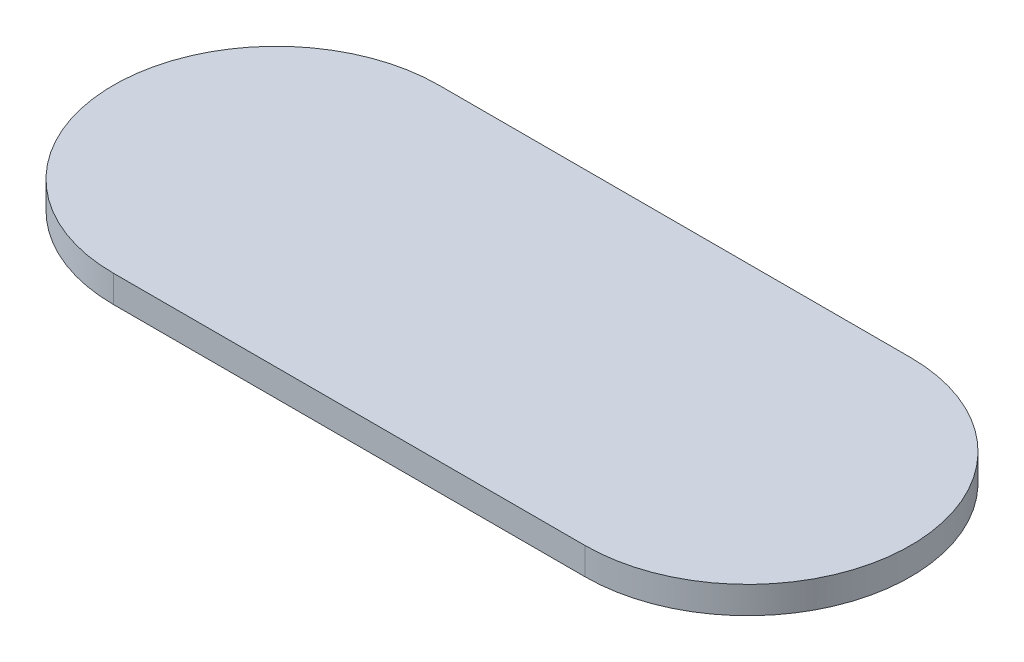
ISO-10303-21;
HEADER;
FILE_DESCRIPTION(('STEP AP214'),'2;1');
FILE_NAME('part.step','',(''),(''),'','','');
FILE_SCHEMA(('AUTOMOTIVE_DESIGN { 1 0 10303 214 1 1 1 1 }'));
ENDSEC;
DATA;
#1=APPLICATION_CONTEXT('core data for automotive mechanical design processes');
#2=APPLICATION_PROTOCOL_DEFINITION('international standard','automotive_design',2000,#1);
#3=PRODUCT_CONTEXT('',#1,'mechanical');
#4=PRODUCT('Part','Part','',(#3));
#5=PRODUCT_RELATED_PRODUCT_CATEGORY('part','',(#4));
#6=PRODUCT_DEFINITION_FORMATION('','',#4);
#7=PRODUCT_DEFINITION_CONTEXT('part definition',#1,'design');
#8=PRODUCT_DEFINITION('design','',#6,#7);
#9=PRODUCT_DEFINITION_SHAPE('','',#8);
#10=(LENGTH_UNIT() NAMED_UNIT(*) SI_UNIT(.MILLI.,.METRE.));
#11=(NAMED_UNIT(*) PLANE_ANGLE_UNIT() SI_UNIT($,.RADIAN.));
#12=(NAMED_UNIT(*) SI_UNIT($,.STERADIAN.) SOLID_ANGLE_UNIT());
#13=UNCERTAINTY_MEASURE_WITH_UNIT(LENGTH_MEASURE(1.E-05),#10,'distance_accuracy_value','');
#14=(GEOMETRIC_REPRESENTATION_CONTEXT(3) GLOBAL_UNCERTAINTY_ASSIGNED_CONTEXT((#13)) GLOBAL_UNIT_ASSIGNED_CONTEXT((#10,
#11,#12)) REPRESENTATION_CONTEXT('',''));
#15=CARTESIAN_POINT('',(0.,0.,0.));
#16=DIRECTION('',(0.,0.,1.));
#17=DIRECTION('',(1.,0.,0.));
#18=AXIS2_PLACEMENT_3D('',#15,#16,#17);
#19=CARTESIAN_POINT('',(-114.392523364486,10.,0.));
#20=DIRECTION('',(0.,-1.,0.));
#21=DIRECTION('',(0.,0.,-1.));
#22=AXIS2_PLACEMENT_3D('',#19,#20,#21);
#23=CYLINDRICAL_SURFACE('',#22,60.);
#24=CARTESIAN_POINT('',(-114.392523364486,0.,0.));
#25=DIRECTION('',(0.,1.,0.));
#26=DIRECTION('',(0.,0.,1.));
#27=AXIS2_PLACEMENT_3D('',#24,#25,#26);
#28=CIRCLE('',#27,60.);
#29=CARTESIAN_POINT('',(-114.392523364486,0.,-60.));
#30=VERTEX_POINT('',#29);
#31=CARTESIAN_POINT('',(-114.392523364486,0.,60.));
#32=VERTEX_POINT('',#31);
#33=EDGE_CURVE('E113',#30,#32,#28,.T.);
#34=ORIENTED_EDGE('',*,*,#33,.T.);
#35=DIRECTION('',(0.,-1.,0.));
#36=VECTOR('',#35,1.);
#37=CARTESIAN_POINT('',(-114.392523364486,10.,60.));
#38=LINE('',#37,#36);
#39=CARTESIAN_POINT('',(-114.392523364486,10.,60.));
#40=VERTEX_POINT('',#39);
#41=EDGE_CURVE('E11',#40,#32,#38,.T.);
#42=ORIENTED_EDGE('',*,*,#41,.F.);
#43=CARTESIAN_POINT('',(-114.392523364486,10.,0.));
#44=DIRECTION('',(0.,1.,0.));
#45=DIRECTION('',(0.,0.,1.));
#46=AXIS2_PLACEMENT_3D('',#43,#44,#45);
#47=CIRCLE('',#46,60.);
#48=CARTESIAN_POINT('',(-114.392523364486,10.,-60.));
#49=VERTEX_POINT('',#48);
#50=EDGE_CURVE('E97',#49,#40,#47,.T.);
#51=ORIENTED_EDGE('',*,*,#50,.F.);
#52=DIRECTION('',(0.,-1.,0.));
#53=VECTOR('',#52,1.);
#54=CARTESIAN_POINT('',(-114.392523364486,10.,-60.));
#55=LINE('',#54,#53);
#56=EDGE_CURVE('E109',#49,#30,#55,.T.);
#57=ORIENTED_EDGE('',*,*,#56,.T.);
#58=EDGE_LOOP('',(#34,#42,#51,#57));
#59=FACE_BOUND('',#58,.T.);
#60=ADVANCED_FACE('F45',(#59),#23,.T.);
#61=CARTESIAN_POINT('',(-114.392523364486,10.,60.));
#62=DIRECTION('',(0.,0.,-1.));
#63=DIRECTION('',(-1.,0.,0.));
#64=AXIS2_PLACEMENT_3D('',#61,#62,#63);
#65=PLANE('',#64);
#66=DIRECTION('',(1.,0.,0.));
#67=VECTOR('',#66,1.);
#68=CARTESIAN_POINT('',(-114.392523364486,0.,60.));
#69=LINE('',#68,#67);
#70=CARTESIAN_POINT('',(59.4392523364487,0.,60.));
#71=VERTEX_POINT('',#70);
#72=EDGE_CURVE('E102',#32,#71,#69,.T.);
#73=ORIENTED_EDGE('',*,*,#72,.T.);
#74=DIRECTION('',(0.,-1.,0.));
#75=VECTOR('',#74,1.);
#76=CARTESIAN_POINT('',(59.4392523364487,10.,60.));
#77=LINE('',#76,#75);
#78=CARTESIAN_POINT('',(59.4392523364487,10.,60.));
#79=VERTEX_POINT('',#78);
#80=EDGE_CURVE('E54',#79,#71,#77,.T.);
#81=ORIENTED_EDGE('',*,*,#80,.F.);
#82=DIRECTION('',(1.,0.,0.));
#83=VECTOR('',#82,1.);
#84=CARTESIAN_POINT('',(-114.392523364486,10.,60.));
#85=LINE('',#84,#83);
#86=EDGE_CURVE('E92',#40,#79,#85,.T.);
#87=ORIENTED_EDGE('',*,*,#86,.F.);
#88=ORIENTED_EDGE('',*,*,#41,.T.);
#89=EDGE_LOOP('',(#73,#81,#87,#88));
#90=FACE_BOUND('',#89,.T.);
#91=ADVANCED_FACE('F101',(#90),#65,.F.);
#92=CARTESIAN_POINT('',(59.4392523364487,10.,0.));
#93=DIRECTION('',(0.,-1.,0.));
#94=DIRECTION('',(0.,0.,-1.));
#95=AXIS2_PLACEMENT_3D('',#92,#93,#94);
#96=CYLINDRICAL_SURFACE('',#95,60.);
#97=CARTESIAN_POINT('',(59.4392523364487,0.,0.));
#98=DIRECTION('',(0.,1.,0.));
#99=DIRECTION('',(0.,0.,1.));
#100=AXIS2_PLACEMENT_3D('',#97,#98,#99);
#101=CIRCLE('',#100,60.);
#102=CARTESIAN_POINT('',(59.4392523364487,0.,-60.));
#103=VERTEX_POINT('',#102);
#104=EDGE_CURVE('E79',#71,#103,#101,.T.);
#105=ORIENTED_EDGE('',*,*,#104,.T.);
#106=DIRECTION('',(0.,-1.,0.));
#107=VECTOR('',#106,1.);
#108=CARTESIAN_POINT('',(59.4392523364487,10.,-60.));
#109=LINE('',#108,#107);
#110=CARTESIAN_POINT('',(59.4392523364487,10.,-60.));
#111=VERTEX_POINT('',#110);
#112=EDGE_CURVE('E104',#111,#103,#109,.T.);
#113=ORIENTED_EDGE('',*,*,#112,.F.);
#114=CARTESIAN_POINT('',(59.4392523364487,10.,0.));
#115=DIRECTION('',(0.,1.,0.));
#116=DIRECTION('',(0.,0.,1.));
#117=AXIS2_PLACEMENT_3D('',#114,#115,#116);
#118=CIRCLE('',#117,60.);
#119=EDGE_CURVE('E95',#79,#111,#118,.T.);
#120=ORIENTED_EDGE('',*,*,#119,.F.);
#121=ORIENTED_EDGE('',*,*,#80,.T.);
#122=EDGE_LOOP('',(#105,#113,#120,#121));
#123=FACE_BOUND('',#122,.T.);
#124=ADVANCED_FACE('F105',(#123),#96,.T.);
#125=CARTESIAN_POINT('',(-114.392523364486,10.,-60.));
#126=DIRECTION('',(0.,0.,1.));
#127=DIRECTION('',(1.,0.,0.));
#128=AXIS2_PLACEMENT_3D('',#125,#126,#127);
#129=PLANE('',#128);
#130=DIRECTION('',(-1.,0.,0.));
#131=VECTOR('',#130,1.);
#132=CARTESIAN_POINT('',(-114.392523364486,0.,-60.));
#133=LINE('',#132,#131);
#134=EDGE_CURVE('E85',#103,#30,#133,.T.);
#135=ORIENTED_EDGE('',*,*,#134,.T.);
#136=ORIENTED_EDGE('',*,*,#56,.F.);
#137=DIRECTION('',(-1.,0.,0.));
#138=VECTOR('',#137,1.);
#139=CARTESIAN_POINT('',(-114.392523364486,10.,-60.));
#140=LINE('',#139,#138);
#141=EDGE_CURVE('E62',#111,#49,#140,.T.);
#142=ORIENTED_EDGE('',*,*,#141,.F.);
#143=ORIENTED_EDGE('',*,*,#112,.T.);
#144=EDGE_LOOP('',(#135,#136,#142,#143));
#145=FACE_BOUND('',#144,.T.);
#146=ADVANCED_FACE('F126',(#145),#129,.F.);
#147=CARTESIAN_POINT('',(-114.392523364486,10.,0.));
#148=DIRECTION('',(0.,1.,0.));
#149=DIRECTION('',(0.,0.,1.));
#150=AXIS2_PLACEMENT_3D('',#147,#148,#149);
#151=PLANE('',#150);
#152=ORIENTED_EDGE('',*,*,#50,.T.);
#153=ORIENTED_EDGE('',*,*,#86,.T.);
#154=ORIENTED_EDGE('',*,*,#119,.T.);
#155=ORIENTED_EDGE('',*,*,#141,.T.);
#156=EDGE_LOOP('',(#152,#153,#154,#155));
#157=FACE_BOUND('',#156,.T.);
#158=ADVANCED_FACE('F93',(#157),#151,.T.);
#159=CARTESIAN_POINT('',(-114.392523364486,0.,0.));
#160=DIRECTION('',(0.,1.,0.));
#161=DIRECTION('',(0.,0.,1.));
#162=AXIS2_PLACEMENT_3D('',#159,#160,#161);
#163=PLANE('',#162);
#164=ORIENTED_EDGE('',*,*,#33,.F.);
#165=ORIENTED_EDGE('',*,*,#134,.F.);
#166=ORIENTED_EDGE('',*,*,#104,.F.);
#167=ORIENTED_EDGE('',*,*,#72,.F.);
#168=EDGE_LOOP('',(#164,#165,#166,#167));
#169=FACE_BOUND('',#168,.T.);
#170=ADVANCED_FACE('F129',(#169),#163,.F.);
#171=CLOSED_SHELL('',(#60,#91,#124,#146,#158,#170));
#172=MANIFOLD_SOLID_BREP('B2',#171);
#173=ADVANCED_BREP_SHAPE_REPRESENTATION('',(#18,#172),#14);
#174=SHAPE_DEFINITION_REPRESENTATION(#9,#173);
ENDSEC;
END-ISO-10303-21;
